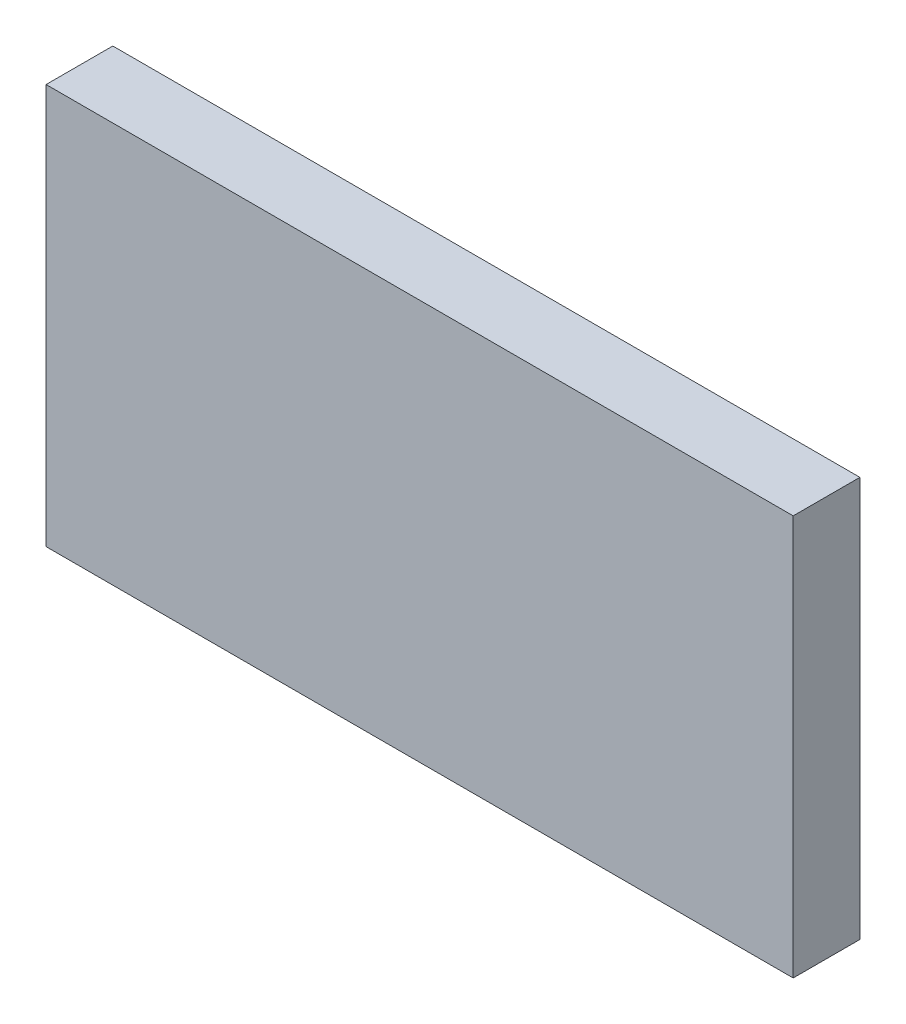
ISO-10303-21;
HEADER;
FILE_DESCRIPTION(('STEP AP214'),'2;1');
FILE_NAME('part.step','',(''),(''),'','','');
FILE_SCHEMA(('AUTOMOTIVE_DESIGN { 1 0 10303 214 1 1 1 1 }'));
ENDSEC;
DATA;
#1=APPLICATION_CONTEXT('core data for automotive mechanical design processes');
#2=APPLICATION_PROTOCOL_DEFINITION('international standard','automotive_design',2000,#1);
#3=PRODUCT_CONTEXT('',#1,'mechanical');
#4=PRODUCT('Part','Part','',(#3));
#5=PRODUCT_RELATED_PRODUCT_CATEGORY('part','',(#4));
#6=PRODUCT_DEFINITION_FORMATION('','',#4);
#7=PRODUCT_DEFINITION_CONTEXT('part definition',#1,'design');
#8=PRODUCT_DEFINITION('design','',#6,#7);
#9=PRODUCT_DEFINITION_SHAPE('','',#8);
#10=(LENGTH_UNIT() NAMED_UNIT(*) SI_UNIT(.MILLI.,.METRE.));
#11=(NAMED_UNIT(*) PLANE_ANGLE_UNIT() SI_UNIT($,.RADIAN.));
#12=(NAMED_UNIT(*) SI_UNIT($,.STERADIAN.) SOLID_ANGLE_UNIT());
#13=UNCERTAINTY_MEASURE_WITH_UNIT(LENGTH_MEASURE(1.E-05),#10,'distance_accuracy_value','');
#14=(GEOMETRIC_REPRESENTATION_CONTEXT(3) GLOBAL_UNCERTAINTY_ASSIGNED_CONTEXT((#13)) GLOBAL_UNIT_ASSIGNED_CONTEXT((#10,
#11,#12)) REPRESENTATION_CONTEXT('',''));
#15=CARTESIAN_POINT('',(0.,0.,0.));
#16=DIRECTION('',(0.,0.,1.));
#17=DIRECTION('',(1.,0.,0.));
#18=AXIS2_PLACEMENT_3D('',#15,#16,#17);
#19=CARTESIAN_POINT('',(-0.513736998032061,-0.749996420067804,0.0826433070866142));
#20=DIRECTION('',(0.,0.,1.));
#21=DIRECTION('',(0.,-1.,0.));
#22=AXIS2_PLACEMENT_3D('',#19,#20,#21);
#23=PLANE('',#22);
#24=DIRECTION('',(0.,1.,0.));
#25=VECTOR('',#24,1.);
#26=CARTESIAN_POINT('',(-0.587815738189541,-0.749996420067804,0.0826433070866142));
#27=LINE('',#26,#25);
#28=CARTESIAN_POINT('',(-0.587815738189541,-0.748106656288277,0.0826433070866142));
#29=VERTEX_POINT('',#28);
#30=CARTESIAN_POINT('',(-0.587815738189541,-0.710311380697725,0.0826433070866142));
#31=VERTEX_POINT('',#30);
#32=EDGE_CURVE('E71',#29,#31,#27,.T.);
#33=ORIENTED_EDGE('',*,*,#32,.T.);
#34=DIRECTION('',(1.,0.,0.));
#35=VECTOR('',#34,1.);
#36=CARTESIAN_POINT('',(-0.513736998032061,-0.710311380697725,0.0826433070866142));
#37=LINE('',#36,#35);
#38=CARTESIAN_POINT('',(-0.517264557087179,-0.710311380697725,0.0826433070866142));
#39=VERTEX_POINT('',#38);
#40=EDGE_CURVE('E54',#39,#31,#37,.F.);
#41=ORIENTED_EDGE('',*,*,#40,.F.);
#42=DIRECTION('',(0.,1.,0.));
#43=VECTOR('',#42,1.);
#44=CARTESIAN_POINT('',(-0.517264557087179,-0.749996420067804,0.0826433070866142));
#45=LINE('',#44,#43);
#46=CARTESIAN_POINT('',(-0.517264557087179,-0.748106656288277,0.0826433070866142));
#47=VERTEX_POINT('',#46);
#48=EDGE_CURVE('E20',#47,#39,#45,.T.);
#49=ORIENTED_EDGE('',*,*,#48,.F.);
#50=DIRECTION('',(1.,0.,0.));
#51=VECTOR('',#50,1.);
#52=CARTESIAN_POINT('',(-0.591343297244659,-0.748106656288277,0.0826433070866142));
#53=LINE('',#52,#51);
#54=EDGE_CURVE('E81',#29,#47,#53,.T.);
#55=ORIENTED_EDGE('',*,*,#54,.F.);
#56=EDGE_LOOP('',(#33,#41,#49,#55));
#57=FACE_BOUND('',#56,.T.);
#58=ADVANCED_FACE('F17',(#57),#23,.F.);
#59=CARTESIAN_POINT('',(-0.517264557087179,-0.749996420067804,0.0823283464566929));
#60=DIRECTION('',(-1.,0.,0.));
#61=DIRECTION('',(0.,0.,1.));
#62=AXIS2_PLACEMENT_3D('',#59,#60,#61);
#63=PLANE('',#62);
#64=DIRECTION('',(0.,0.,1.));
#65=VECTOR('',#64,1.);
#66=CARTESIAN_POINT('',(-0.517264557087179,-0.748106656288277,0.0823283464566929));
#67=LINE('',#66,#65);
#68=CARTESIAN_POINT('',(-0.517264557087179,-0.748106656288277,0.0889425196850394));
#69=VERTEX_POINT('',#68);
#70=EDGE_CURVE('E64',#47,#69,#67,.T.);
#71=ORIENTED_EDGE('',*,*,#70,.F.);
#72=ORIENTED_EDGE('',*,*,#48,.T.);
#73=DIRECTION('',(0.,0.,-1.));
#74=VECTOR('',#73,1.);
#75=CARTESIAN_POINT('',(-0.517264557087179,-0.710311380697725,0.0823283464566929));
#76=LINE('',#75,#74);
#77=CARTESIAN_POINT('',(-0.517264557087179,-0.710311380697725,0.0889425196850394));
#78=VERTEX_POINT('',#77);
#79=EDGE_CURVE('E62',#78,#39,#76,.T.);
#80=ORIENTED_EDGE('',*,*,#79,.F.);
#81=DIRECTION('',(0.,1.,0.));
#82=VECTOR('',#81,1.);
#83=CARTESIAN_POINT('',(-0.517264557087179,-0.749996420067804,0.0889425196850394));
#84=LINE('',#83,#82);
#85=EDGE_CURVE('E83',#69,#78,#84,.T.);
#86=ORIENTED_EDGE('',*,*,#85,.F.);
#87=EDGE_LOOP('',(#71,#72,#80,#86));
#88=FACE_BOUND('',#87,.T.);
#89=ADVANCED_FACE('F60',(#88),#63,.F.);
#90=CARTESIAN_POINT('',(-0.513736998032061,-0.710311380697725,0.0823283464566929));
#91=DIRECTION('',(0.,-1.,0.));
#92=DIRECTION('',(0.,0.,-1.));
#93=AXIS2_PLACEMENT_3D('',#90,#91,#92);
#94=PLANE('',#93);
#95=DIRECTION('',(0.,0.,1.));
#96=VECTOR('',#95,1.);
#97=CARTESIAN_POINT('',(-0.587815738189541,-0.710311380697725,0.0823283464566929));
#98=LINE('',#97,#96);
#99=CARTESIAN_POINT('',(-0.587815738189541,-0.710311380697725,0.0889425196850394));
#100=VERTEX_POINT('',#99);
#101=EDGE_CURVE('E73',#31,#100,#98,.T.);
#102=ORIENTED_EDGE('',*,*,#101,.T.);
#103=DIRECTION('',(1.,0.,0.));
#104=VECTOR('',#103,1.);
#105=CARTESIAN_POINT('',(-0.513736998032061,-0.710311380697725,0.0889425196850394));
#106=LINE('',#105,#104);
#107=EDGE_CURVE('E69',#78,#100,#106,.F.);
#108=ORIENTED_EDGE('',*,*,#107,.F.);
#109=ORIENTED_EDGE('',*,*,#79,.T.);
#110=ORIENTED_EDGE('',*,*,#40,.T.);
#111=EDGE_LOOP('',(#102,#108,#109,#110));
#112=FACE_BOUND('',#111,.T.);
#113=ADVANCED_FACE('F68',(#112),#94,.F.);
#114=CARTESIAN_POINT('',(-0.587815738189541,-0.749996420067804,0.0823283464566929));
#115=DIRECTION('',(-1.,0.,0.));
#116=DIRECTION('',(0.,0.,1.));
#117=AXIS2_PLACEMENT_3D('',#114,#115,#116);
#118=PLANE('',#117);
#119=ORIENTED_EDGE('',*,*,#32,.F.);
#120=DIRECTION('',(0.,0.,1.));
#121=VECTOR('',#120,1.);
#122=CARTESIAN_POINT('',(-0.587815738189541,-0.748106656288277,0.0823283464566929));
#123=LINE('',#122,#121);
#124=CARTESIAN_POINT('',(-0.587815738189541,-0.748106656288277,0.0889425196850394));
#125=VERTEX_POINT('',#124);
#126=EDGE_CURVE('E78',#125,#29,#123,.F.);
#127=ORIENTED_EDGE('',*,*,#126,.F.);
#128=DIRECTION('',(0.,1.,0.));
#129=VECTOR('',#128,1.);
#130=CARTESIAN_POINT('',(-0.587815738189541,-0.749996420067804,0.0889425196850394));
#131=LINE('',#130,#129);
#132=EDGE_CURVE('E26',#100,#125,#131,.F.);
#133=ORIENTED_EDGE('',*,*,#132,.F.);
#134=ORIENTED_EDGE('',*,*,#101,.F.);
#135=EDGE_LOOP('',(#119,#127,#133,#134));
#136=FACE_BOUND('',#135,.T.);
#137=ADVANCED_FACE('F88',(#136),#118,.T.);
#138=CARTESIAN_POINT('',(-0.591343297244659,-0.748106656288277,0.0823283464566929));
#139=DIRECTION('',(0.,1.,0.));
#140=DIRECTION('',(0.,0.,1.));
#141=AXIS2_PLACEMENT_3D('',#138,#139,#140);
#142=PLANE('',#141);
#143=ORIENTED_EDGE('',*,*,#126,.T.);
#144=ORIENTED_EDGE('',*,*,#54,.T.);
#145=ORIENTED_EDGE('',*,*,#70,.T.);
#146=DIRECTION('',(1.,0.,0.));
#147=VECTOR('',#146,1.);
#148=CARTESIAN_POINT('',(-0.513736998032061,-0.748106656288277,0.0889425196850394));
#149=LINE('',#148,#147);
#150=EDGE_CURVE('E11',#125,#69,#149,.T.);
#151=ORIENTED_EDGE('',*,*,#150,.F.);
#152=EDGE_LOOP('',(#143,#144,#145,#151));
#153=FACE_BOUND('',#152,.T.);
#154=ADVANCED_FACE('F91',(#153),#142,.F.);
#155=CARTESIAN_POINT('',(-0.513736998032061,-0.749996420067804,0.0889425196850394));
#156=DIRECTION('',(0.,0.,-1.));
#157=DIRECTION('',(0.,1.,0.));
#158=AXIS2_PLACEMENT_3D('',#155,#156,#157);
#159=PLANE('',#158);
#160=ORIENTED_EDGE('',*,*,#132,.T.);
#161=ORIENTED_EDGE('',*,*,#150,.T.);
#162=ORIENTED_EDGE('',*,*,#85,.T.);
#163=ORIENTED_EDGE('',*,*,#107,.T.);
#164=EDGE_LOOP('',(#160,#161,#162,#163));
#165=FACE_BOUND('',#164,.T.);
#166=ADVANCED_FACE('F86',(#165),#159,.F.);
#167=CLOSED_SHELL('',(#58,#89,#113,#137,#154,#166));
#168=MANIFOLD_SOLID_BREP('B1',#167);
#169=ADVANCED_BREP_SHAPE_REPRESENTATION('',(#18,#168),#14);
#170=SHAPE_DEFINITION_REPRESENTATION(#9,#169);
ENDSEC;
END-ISO-10303-21;
